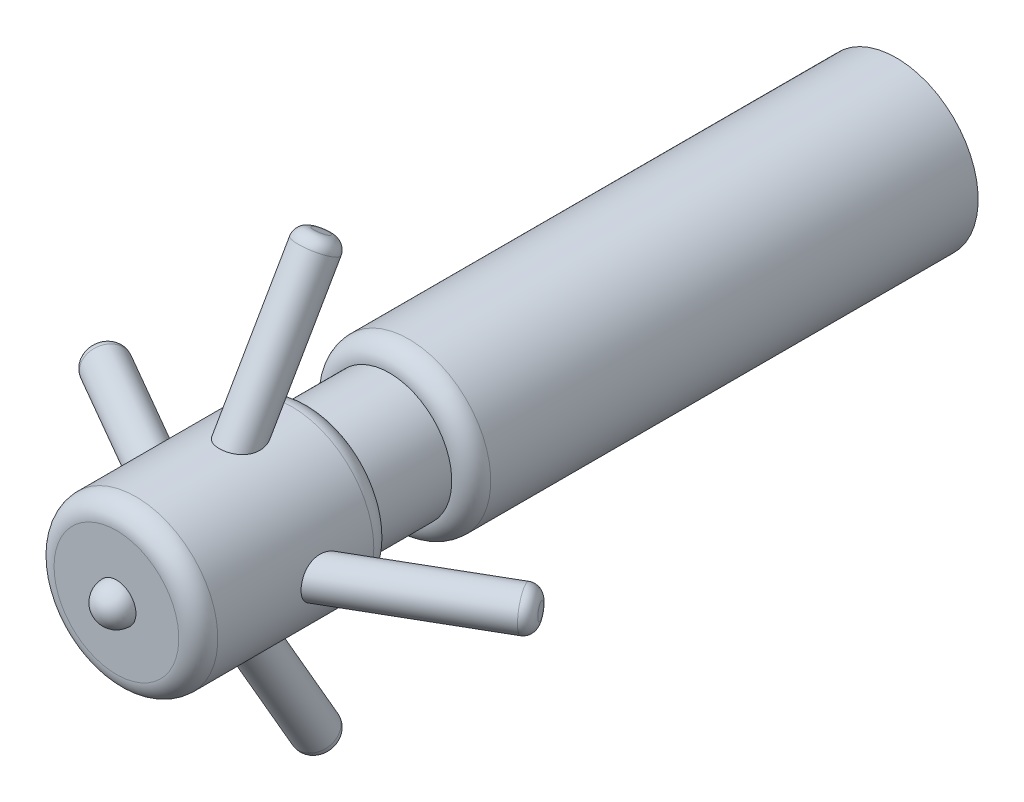
ISO-10303-21;
HEADER;
FILE_DESCRIPTION(('STEP AP214'),'2;1');
FILE_NAME('part.step','',(''),(''),'','','');
FILE_SCHEMA(('AUTOMOTIVE_DESIGN { 1 0 10303 214 1 1 1 1 }'));
ENDSEC;
DATA;
#1=APPLICATION_CONTEXT('core data for automotive mechanical design processes');
#2=APPLICATION_PROTOCOL_DEFINITION('international standard','automotive_design',2000,#1);
#3=PRODUCT_CONTEXT('',#1,'mechanical');
#4=PRODUCT('Part','Part','',(#3));
#5=PRODUCT_RELATED_PRODUCT_CATEGORY('part','',(#4));
#6=PRODUCT_DEFINITION_FORMATION('','',#4);
#7=PRODUCT_DEFINITION_CONTEXT('part definition',#1,'design');
#8=PRODUCT_DEFINITION('design','',#6,#7);
#9=PRODUCT_DEFINITION_SHAPE('','',#8);
#10=(LENGTH_UNIT() NAMED_UNIT(*) SI_UNIT(.MILLI.,.METRE.));
#11=(NAMED_UNIT(*) PLANE_ANGLE_UNIT() SI_UNIT($,.RADIAN.));
#12=(NAMED_UNIT(*) SI_UNIT($,.STERADIAN.) SOLID_ANGLE_UNIT());
#13=UNCERTAINTY_MEASURE_WITH_UNIT(LENGTH_MEASURE(1.E-05),#10,'distance_accuracy_value','');
#14=(GEOMETRIC_REPRESENTATION_CONTEXT(3) GLOBAL_UNCERTAINTY_ASSIGNED_CONTEXT((#13)) GLOBAL_UNIT_ASSIGNED_CONTEXT((#10,
#11,#12)) REPRESENTATION_CONTEXT('',''));
#15=CARTESIAN_POINT('',(0.,0.,0.));
#16=DIRECTION('',(0.,0.,1.));
#17=DIRECTION('',(1.,0.,0.));
#18=AXIS2_PLACEMENT_3D('',#15,#16,#17);
#19=CARTESIAN_POINT('',(0.,0.,20.));
#20=DIRECTION('',(0.,0.,-1.));
#21=DIRECTION('',(1.,0.,0.));
#22=AXIS2_PLACEMENT_3D('',#19,#20,#21);
#23=SPHERICAL_SURFACE('',#22,0.5);
#24=CARTESIAN_POINT('',(0.,0.,20.));
#25=DIRECTION('',(0.,0.,-1.));
#26=DIRECTION('',(-1.,0.,0.));
#27=AXIS2_PLACEMENT_3D('',#24,#25,#26);
#28=CIRCLE('',#27,0.5);
#29=CARTESIAN_POINT('',(-0.499999999999998,0.,20.));
#30=VERTEX_POINT('',#29);
#31=EDGE_CURVE('E160',#30,#30,#28,.T.);
#32=ORIENTED_EDGE('',*,*,#31,.F.);
#33=EDGE_LOOP('',(#32));
#34=FACE_BOUND('',#33,.T.);
#35=ADVANCED_FACE('F33',(#34),#23,.T.);
#36=CARTESIAN_POINT('',(0.500000000000003,0.,20.));
#37=DIRECTION('',(0.,0.,-1.));
#38=DIRECTION('',(-1.,0.,0.));
#39=AXIS2_PLACEMENT_3D('',#36,#37,#38);
#40=PLANE('',#39);
#41=CARTESIAN_POINT('',(0.,0.,20.));
#42=DIRECTION('',(0.,0.,-1.));
#43=DIRECTION('',(-1.,0.,0.));
#44=AXIS2_PLACEMENT_3D('',#41,#42,#43);
#45=CIRCLE('',#44,1.6);
#46=CARTESIAN_POINT('',(-1.59999999999999,0.,20.));
#47=VERTEX_POINT('',#46);
#48=EDGE_CURVE('E163',#47,#47,#45,.T.);
#49=ORIENTED_EDGE('',*,*,#48,.F.);
#50=EDGE_LOOP('',(#49));
#51=FACE_BOUND('',#50,.T.);
#52=ORIENTED_EDGE('',*,*,#31,.T.);
#53=EDGE_LOOP('',(#52));
#54=FACE_BOUND('',#53,.T.);
#55=ADVANCED_FACE('F152',(#51,#54),#40,.F.);
#56=CARTESIAN_POINT('',(0.,0.,19.5));
#57=DIRECTION('',(0.,0.,-1.));
#58=DIRECTION('',(-1.,0.,0.));
#59=AXIS2_PLACEMENT_3D('',#56,#57,#58);
#60=TOROIDAL_SURFACE('',#59,1.6,0.5);
#61=CARTESIAN_POINT('',(0.,0.,19.5));
#62=DIRECTION('',(0.,0.,-1.));
#63=DIRECTION('',(-1.,0.,0.));
#64=AXIS2_PLACEMENT_3D('',#61,#62,#63);
#65=CIRCLE('',#64,2.1);
#66=CARTESIAN_POINT('',(-2.1,0.,19.5));
#67=VERTEX_POINT('',#66);
#68=EDGE_CURVE('E167',#67,#67,#65,.T.);
#69=ORIENTED_EDGE('',*,*,#68,.F.);
#70=EDGE_LOOP('',(#69));
#71=FACE_BOUND('',#70,.T.);
#72=ORIENTED_EDGE('',*,*,#48,.T.);
#73=EDGE_LOOP('',(#72));
#74=FACE_BOUND('',#73,.T.);
#75=ADVANCED_FACE('F147',(#71,#74),#60,.T.);
#76=CARTESIAN_POINT('',(0.,0.,0.));
#77=DIRECTION('',(0.,0.,-1.));
#78=DIRECTION('',(-1.,0.,0.));
#79=AXIS2_PLACEMENT_3D('',#76,#77,#78);
#80=CYLINDRICAL_SURFACE('',#79,2.1);
#81=CARTESIAN_POINT('',(2.1,0.,17.3649147038915));
#82=CARTESIAN_POINT('',(2.10000013534698,0.0270170558608786,17.3649149600796));
#83=CARTESIAN_POINT('',(2.09947389495133,0.0540321101324294,17.362682637695));
#84=CARTESIAN_POINT('',(2.09742685160139,0.107287831584698,17.3538120437736));
#85=CARTESIAN_POINT('',(2.09590615334828,0.133528579984027,17.3471742360659));
#86=CARTESIAN_POINT('',(2.09203682808871,0.184486488805317,17.3296707766783));
#87=CARTESIAN_POINT('',(2.08968840637528,0.20920402523202,17.3188061732644));
#88=CARTESIAN_POINT('',(2.08441949205406,0.256438812860933,17.2931500051854));
#89=CARTESIAN_POINT('',(2.08149901159444,0.27895611077199,17.2783585239087));
#90=CARTESIAN_POINT('',(2.07537781948196,0.321356347266318,17.2451572676696));
#91=CARTESIAN_POINT('',(2.07217527613834,0.341219579433097,17.2267227015647));
#92=CARTESIAN_POINT('',(2.06584358018548,0.377668413517458,17.1868532793931));
#93=CARTESIAN_POINT('',(2.06271443313305,0.394253767968713,17.1654181970081));
#94=CARTESIAN_POINT('',(2.05673250454513,0.42437757110458,17.1193856937886));
#95=CARTESIAN_POINT('',(2.05389315252176,0.437789710924941,17.0947041064263));
#96=CARTESIAN_POINT('',(2.04888139395525,0.460676216341731,17.0435213855989));
#97=CARTESIAN_POINT('',(2.04670919882964,0.470149334024396,17.0170196785989));
#98=CARTESIAN_POINT('',(2.04305273215899,0.485804566358789,16.9606876323107));
#99=CARTESIAN_POINT('',(2.04163857678029,0.491657294939515,16.9307616842427));
#100=CARTESIAN_POINT('',(2.03985887629031,0.49898822205063,16.8703556441127));
#101=CARTESIAN_POINT('',(2.0394937643768,0.500464613400271,16.839875328354));
#102=CARTESIAN_POINT('',(2.03980213630231,0.49920790530019,16.7751434615066));
#103=CARTESIAN_POINT('',(2.04061309280366,0.49591767597866,16.7409034671232));
#104=CARTESIAN_POINT('',(2.0433749395959,0.484409692666091,16.6732919406647));
#105=CARTESIAN_POINT('',(2.04532693848286,0.476187146408223,16.6399212861905));
#106=CARTESIAN_POINT('',(2.05042096887334,0.453786505557318,16.5708804944482));
#107=CARTESIAN_POINT('',(2.05367699960968,0.439015988017886,16.5354094953734));
#108=CARTESIAN_POINT('',(2.06089886995535,0.403756472101983,16.4674983715522));
#109=CARTESIAN_POINT('',(2.06486431716247,0.383270631576743,16.4350565862673));
#110=CARTESIAN_POINT('',(2.07206297401812,0.341892415598992,16.381339196235));
#111=CARTESIAN_POINT('',(2.0752606449846,0.322124407818175,16.3591920737751));
#112=CARTESIAN_POINT('',(2.08146131694597,0.279259443097254,16.3183635594363));
#113=CARTESIAN_POINT('',(2.08446461777478,0.256167799619382,16.2996767426119));
#114=CARTESIAN_POINT('',(2.08940704680269,0.21161201198238,16.2699426125728));
#115=CARTESIAN_POINT('',(2.09143987391839,0.19067895649521,16.2581179004268));
#116=CARTESIAN_POINT('',(2.09495442737949,0.147112038001296,16.2380376588472));
#117=CARTESIAN_POINT('',(2.09643651016618,0.124479286479753,16.2297798203719));
#118=CARTESIAN_POINT('',(2.09868433436348,0.0779092196004576,16.2173616516538));
#119=CARTESIAN_POINT('',(2.09944545237326,0.0539645123058211,16.2132277585759));
#120=CARTESIAN_POINT('',(2.10013055186416,0.00571283440946461,16.2095033670868));
#121=CARTESIAN_POINT('',(2.10005487599663,-0.0185939838431219,16.2099110090031));
#122=CARTESIAN_POINT('',(2.09913048565165,-0.0641599620608656,16.2149447287968));
#123=CARTESIAN_POINT('',(2.09836341877521,-0.0854720661027792,16.2191253176157));
#124=CARTESIAN_POINT('',(2.09625237617656,-0.127126929428398,16.2308085790678));
#125=CARTESIAN_POINT('',(2.09490832730107,-0.147469565433567,16.2383116729521));
#126=CARTESIAN_POINT('',(2.09170109037234,-0.187645926044249,16.256615365473));
#127=CARTESIAN_POINT('',(2.08981769869844,-0.207418083878499,16.267546288707));
#128=CARTESIAN_POINT('',(2.0857221477503,-0.245204266217458,16.2920555196805));
#129=CARTESIAN_POINT('',(2.08350974740615,-0.263216985383101,16.3056357709197));
#130=CARTESIAN_POINT('',(2.07784741190989,-0.305264170745404,16.3417717880896));
#131=CARTESIAN_POINT('',(2.07429909016047,-0.328221108462538,16.3655706029834));
#132=CARTESIAN_POINT('',(2.06726634480154,-0.369944883708094,16.4166038751656));
#133=CARTESIAN_POINT('',(2.06378203243842,-0.38870496251785,16.4438437652384));
#134=CARTESIAN_POINT('',(2.05718999426136,-0.422214024555062,16.5012290293635));
#135=CARTESIAN_POINT('',(2.05408811941643,-0.436904172795407,16.5314092683357));
#136=CARTESIAN_POINT('',(2.04862380073636,-0.461847686310299,16.5936016354477));
#137=CARTESIAN_POINT('',(2.04626134933996,-0.472101096954919,16.625613744851));
#138=CARTESIAN_POINT('',(2.04223391007567,-0.489256651354719,16.6959592864633));
#139=CARTESIAN_POINT('',(2.04073664696461,-0.495379951350437,16.734496123406));
#140=CARTESIAN_POINT('',(2.03935724630288,-0.501030518456224,16.8121113960749));
#141=CARTESIAN_POINT('',(2.03947551094671,-0.500556143038308,16.851189964249));
#142=CARTESIAN_POINT('',(2.04140263620674,-0.492637464185869,16.9272154609909));
#143=CARTESIAN_POINT('',(2.04315119144442,-0.485441768872929,16.9641887606865));
#144=CARTESIAN_POINT('',(2.04810935822316,-0.464077651127205,17.0359599772734));
#145=CARTESIAN_POINT('',(2.05131703919534,-0.449918440117621,17.0707606997278));
#146=CARTESIAN_POINT('',(2.05821647195102,-0.417111902889281,17.1319618207609));
#147=CARTESIAN_POINT('',(2.0617791558553,-0.399360809433103,17.1588576582524));
#148=CARTESIAN_POINT('',(2.06917746723406,-0.359056879331339,17.2087312468116));
#149=CARTESIAN_POINT('',(2.07301289316437,-0.336507564305023,17.231711849283));
#150=CARTESIAN_POINT('',(2.07998659418494,-0.290073077223859,17.2704852754232));
#151=CARTESIAN_POINT('',(2.08315478044131,-0.266622656068293,17.28679558492));
#152=CARTESIAN_POINT('',(2.08888978435223,-0.217158441562169,17.3150546143603));
#153=CARTESIAN_POINT('',(2.09145673714156,-0.191145226102814,17.3270043147432));
#154=CARTESIAN_POINT('',(2.09562605959526,-0.138002269492198,17.3459414886458));
#155=CARTESIAN_POINT('',(2.09724990625089,-0.110913763757647,17.3530401584525));
#156=CARTESIAN_POINT('',(2.09943675443007,-0.0558827357357511,17.3625264025123));
#157=CARTESIAN_POINT('',(2.09999986002788,-0.0279402975051137,17.3649144389487));
#158=CARTESIAN_POINT('',(2.1,0.,17.3649147038915));
#159=B_SPLINE_CURVE_WITH_KNOTS('',3,(#81,#82,#83,#84,#85,#86,#87,#88,#89,#90,#91,#92,#93,#94,
#95,#96,#97,#98,#99,#100,#101,#102,#103,#104,#105,#106,#107,#108,#109,#110,#111,#112,#113,#114,
#115,#116,#117,#118,#119,#120,#121,#122,#123,#124,#125,#126,#127,#128,#129,#130,#131,#132,#133,
#134,#135,#136,#137,#138,#139,#140,#141,#142,#143,#144,#145,#146,#147,#148,#149,#150,#151,#152,
#153,#154,#155,#156,#157,#158),.UNSPECIFIED.,.T.,.F.,(4,2,2,2,2,2,2,2,2,2,2,2,2,2,2,2,2,2,2,2,2,
2,2,2,2,2,2,2,2,2,2,2,2,2,2,2,2,2,4),(0.,0.0809513147617417,0.161894107962201,0.242816839736671,
0.323737853229657,0.405229771528635,0.4867278397851,0.571065745582899,0.655430349984879,
0.746640052437077,0.837887414114922,0.940697549231867,1.0436077374186,1.1587681547082,
1.27386506872749,1.36311542747421,1.45222465555415,1.52431978495746,1.59636817284898,
1.66887552542989,1.74135318871538,1.80625338360568,1.87116180936938,1.93892030973865,
2.00672870472036,2.10595927272785,2.20534851162714,2.3061073291602,2.40686511630936,
2.52344124026573,2.64004638701584,2.75250243039203,2.86481011405151,2.96152283588193,
3.05816481945491,3.14394850071515,3.22971288247073,3.31343872510094,3.39715635257019),.UNSPECIFIED.);
#160=CARTESIAN_POINT('',(2.1,0.,17.3649147038915));
#161=VERTEX_POINT('',#160);
#162=EDGE_CURVE('E59',#161,#161,#159,.T.);
#163=ORIENTED_EDGE('',*,*,#162,.T.);
#164=EDGE_LOOP('',(#163));
#165=FACE_BOUND('',#164,.T.);
#166=CARTESIAN_POINT('',(0.,-2.1,17.3649147038915));
#167=CARTESIAN_POINT('',(0.0270170558608737,-2.10000013534698,17.3649149600796));
#168=CARTESIAN_POINT('',(0.0540321101324249,-2.09947389495132,17.362682637695));
#169=CARTESIAN_POINT('',(0.107287831584694,-2.09742685160139,17.3538120437736));
#170=CARTESIAN_POINT('',(0.133528579984022,-2.09590615334828,17.3471742360659));
#171=CARTESIAN_POINT('',(0.184486488805311,-2.09203682808871,17.3296707766783));
#172=CARTESIAN_POINT('',(0.209204025232015,-2.08968840637528,17.3188061732644));
#173=CARTESIAN_POINT('',(0.256438812860928,-2.08441949205405,17.2931500051854));
#174=CARTESIAN_POINT('',(0.278956110771985,-2.08149901159444,17.2783585239087));
#175=CARTESIAN_POINT('',(0.321356347266314,-2.07537781948196,17.2451572676696));
#176=CARTESIAN_POINT('',(0.341219579433096,-2.07217527613834,17.2267227015647));
#177=CARTESIAN_POINT('',(0.377668413517456,-2.06584358018547,17.1868532793931));
#178=CARTESIAN_POINT('',(0.39425376796871,-2.06271443313305,17.1654181970081));
#179=CARTESIAN_POINT('',(0.424377571104576,-2.05673250454513,17.1193856937886));
#180=CARTESIAN_POINT('',(0.437789710924939,-2.05389315252176,17.0947041064263));
#181=CARTESIAN_POINT('',(0.460676216341728,-2.04888139395525,17.0435213855989));
#182=CARTESIAN_POINT('',(0.470149334024392,-2.04670919882963,17.0170196785989));
#183=CARTESIAN_POINT('',(0.485804566358785,-2.04305273215899,16.9606876323107));
#184=CARTESIAN_POINT('',(0.491657294939511,-2.04163857678029,16.9307616842427));
#185=CARTESIAN_POINT('',(0.498988222050625,-2.03985887629031,16.8703556441127));
#186=CARTESIAN_POINT('',(0.500464613400266,-2.0394937643768,16.839875328354));
#187=CARTESIAN_POINT('',(0.499207905300185,-2.03980213630231,16.7751434615066));
#188=CARTESIAN_POINT('',(0.495917675978655,-2.04061309280366,16.7409034671232));
#189=CARTESIAN_POINT('',(0.484409692666086,-2.0433749395959,16.6732919406647));
#190=CARTESIAN_POINT('',(0.476187146408218,-2.04532693848286,16.6399212861905));
#191=CARTESIAN_POINT('',(0.453786505557313,-2.05042096887334,16.5708804944482));
#192=CARTESIAN_POINT('',(0.43901598801788,-2.05367699960967,16.5354094953734));
#193=CARTESIAN_POINT('',(0.403756472101976,-2.06089886995535,16.4674983715522));
#194=CARTESIAN_POINT('',(0.383270631576736,-2.06486431716247,16.4350565862673));
#195=CARTESIAN_POINT('',(0.341892415598984,-2.07206297401812,16.381339196235));
#196=CARTESIAN_POINT('',(0.322124407818167,-2.07526064498459,16.3591920737751));
#197=CARTESIAN_POINT('',(0.279259443097246,-2.08146131694597,16.3183635594363));
#198=CARTESIAN_POINT('',(0.256167799619374,-2.08446461777478,16.2996767426119));
#199=CARTESIAN_POINT('',(0.211612011982371,-2.08940704680268,16.2699426125728));
#200=CARTESIAN_POINT('',(0.190678956495202,-2.09143987391839,16.2581179004268));
#201=CARTESIAN_POINT('',(0.147112038001289,-2.09495442737949,16.2380376588472));
#202=CARTESIAN_POINT('',(0.124479286479747,-2.09643651016617,16.2297798203719));
#203=CARTESIAN_POINT('',(0.0779092196004529,-2.09868433436348,16.2173616516538));
#204=CARTESIAN_POINT('',(0.053964512305817,-2.09944545237325,16.2132277585759));
#205=CARTESIAN_POINT('',(0.00571283440946191,-2.10013055186416,16.2095033670868));
#206=CARTESIAN_POINT('',(-0.018593983843124,-2.10005487599662,16.2099110090031));
#207=CARTESIAN_POINT('',(-0.0641599620608665,-2.09913048565165,16.2149447287968));
#208=CARTESIAN_POINT('',(-0.0854720661027795,-2.09836341877521,16.2191253176157));
#209=CARTESIAN_POINT('',(-0.127126929428399,-2.09625237617656,16.2308085790678));
#210=CARTESIAN_POINT('',(-0.147469565433569,-2.09490832730106,16.2383116729521));
#211=CARTESIAN_POINT('',(-0.187645926044252,-2.09170109037234,16.256615365473));
#212=CARTESIAN_POINT('',(-0.207418083878502,-2.08981769869844,16.267546288707));
#213=CARTESIAN_POINT('',(-0.24520426621746,-2.0857221477503,16.2920555196805));
#214=CARTESIAN_POINT('',(-0.263216985383103,-2.08350974740615,16.3056357709197));
#215=CARTESIAN_POINT('',(-0.305264170745405,-2.07784741190989,16.3417717880896));
#216=CARTESIAN_POINT('',(-0.328221108462539,-2.07429909016047,16.3655706029834));
#217=CARTESIAN_POINT('',(-0.369944883708096,-2.06726634480153,16.4166038751656));
#218=CARTESIAN_POINT('',(-0.388704962517853,-2.06378203243841,16.4438437652384));
#219=CARTESIAN_POINT('',(-0.422214024555064,-2.05718999426136,16.5012290293635));
#220=CARTESIAN_POINT('',(-0.436904172795409,-2.05408811941642,16.5314092683357));
#221=CARTESIAN_POINT('',(-0.461847686310301,-2.04862380073636,16.5936016354477));
#222=CARTESIAN_POINT('',(-0.472101096954922,-2.04626134933996,16.625613744851));
#223=CARTESIAN_POINT('',(-0.489256651354723,-2.04223391007567,16.6959592864633));
#224=CARTESIAN_POINT('',(-0.495379951350441,-2.0407366469646,16.7344961234059));
#225=CARTESIAN_POINT('',(-0.501030518456229,-2.03935724630287,16.8121113960749));
#226=CARTESIAN_POINT('',(-0.500556143038313,-2.0394755109467,16.851189964249));
#227=CARTESIAN_POINT('',(-0.492637464185875,-2.04140263620673,16.9272154609909));
#228=CARTESIAN_POINT('',(-0.485441768872935,-2.04315119144442,16.9641887606865));
#229=CARTESIAN_POINT('',(-0.464077651127212,-2.04810935822316,17.0359599772734));
#230=CARTESIAN_POINT('',(-0.449918440117628,-2.05131703919533,17.0707606997278));
#231=CARTESIAN_POINT('',(-0.417111902889288,-2.05821647195101,17.1319618207609));
#232=CARTESIAN_POINT('',(-0.39936080943311,-2.06177915585529,17.1588576582524));
#233=CARTESIAN_POINT('',(-0.359056879331347,-2.06917746723405,17.2087312468116));
#234=CARTESIAN_POINT('',(-0.33650756430503,-2.07301289316436,17.231711849283));
#235=CARTESIAN_POINT('',(-0.290073077223867,-2.07998659418494,17.2704852754232));
#236=CARTESIAN_POINT('',(-0.266622656068301,-2.08315478044131,17.28679558492));
#237=CARTESIAN_POINT('',(-0.217158441562177,-2.08888978435222,17.3150546143603));
#238=CARTESIAN_POINT('',(-0.191145226102822,-2.09145673714156,17.3270043147432));
#239=CARTESIAN_POINT('',(-0.138002269492206,-2.09562605959526,17.3459414886457));
#240=CARTESIAN_POINT('',(-0.110913763757655,-2.09724990625089,17.3530401584525));
#241=CARTESIAN_POINT('',(-0.0558827357357578,-2.09943675443007,17.3625264025123));
#242=CARTESIAN_POINT('',(-0.0279402975051197,-2.09999986002787,17.3649144389487));
#243=CARTESIAN_POINT('',(0.,-2.1,17.3649147038915));
#244=B_SPLINE_CURVE_WITH_KNOTS('',3,(#166,#167,#168,#169,#170,#171,#172,#173,#174,#175,#176,
#177,#178,#179,#180,#181,#182,#183,#184,#185,#186,#187,#188,#189,#190,#191,#192,#193,#194,#195,
#196,#197,#198,#199,#200,#201,#202,#203,#204,#205,#206,#207,#208,#209,#210,#211,#212,#213,#214,
#215,#216,#217,#218,#219,#220,#221,#222,#223,#224,#225,#226,#227,#228,#229,#230,#231,#232,#233,
#234,#235,#236,#237,#238,#239,#240,#241,#242,#243),.UNSPECIFIED.,.T.,.F.,(4,2,2,2,2,2,2,2,2,2,2,
2,2,2,2,2,2,2,2,2,2,2,2,2,2,2,2,2,2,2,2,2,2,2,2,2,2,2,4),(0.,0.080951314761742,
0.161894107962202,0.24281683973667,0.323737853229659,0.405229771528638,0.486727839785102,
0.571065745582905,0.655430349984882,0.746640052437079,0.837887414114925,0.940697549231866,
1.0436077374186,1.1587681547082,1.2738650687275,1.36311542747421,1.45222465555416,
1.52431978495746,1.59636817284898,1.66887552542989,1.74135318871538,1.80625338360568,
1.87116180936938,1.93892030973864,2.00672870472035,2.10595927272784,2.20534851162714,
2.30610732916019,2.40686511630935,2.52344124026572,2.64004638701583,2.75250243039202,
2.86481011405151,2.96152283588192,3.0581648194549,3.14394850071514,3.22971288247072,
3.31343872510093,3.39715635257019),.UNSPECIFIED.);
#245=CARTESIAN_POINT('',(0.,-2.1,17.3649147038915));
#246=VERTEX_POINT('',#245);
#247=EDGE_CURVE('E66',#246,#246,#244,.T.);
#248=ORIENTED_EDGE('',*,*,#247,.T.);
#249=EDGE_LOOP('',(#248));
#250=FACE_BOUND('',#249,.T.);
#251=CARTESIAN_POINT('',(-2.1,0.,17.3649147038915));
#252=CARTESIAN_POINT('',(-2.10000013534698,-0.0270170558608551,17.3649149600796));
#253=CARTESIAN_POINT('',(-2.09947389495132,-0.0540321101324066,17.362682637695));
#254=CARTESIAN_POINT('',(-2.09742685160139,-0.107287831584676,17.3538120437736));
#255=CARTESIAN_POINT('',(-2.09590615334828,-0.133528579984004,17.3471742360659));
#256=CARTESIAN_POINT('',(-2.0920368280887,-0.184486488805293,17.3296707766783));
#257=CARTESIAN_POINT('',(-2.08968840637528,-0.209204025231996,17.3188061732644));
#258=CARTESIAN_POINT('',(-2.08441949205405,-0.25643881286091,17.2931500051854));
#259=CARTESIAN_POINT('',(-2.08149901159444,-0.278956110771968,17.2783585239087));
#260=CARTESIAN_POINT('',(-2.07537781948196,-0.321356347266298,17.2451572676696));
#261=CARTESIAN_POINT('',(-2.07217527613834,-0.341219579433079,17.2267227015647));
#262=CARTESIAN_POINT('',(-2.06584358018547,-0.37766841351744,17.1868532793931));
#263=CARTESIAN_POINT('',(-2.06271443313305,-0.394253767968694,17.1654181970081));
#264=CARTESIAN_POINT('',(-2.05673250454513,-0.424377571104561,17.1193856937886));
#265=CARTESIAN_POINT('',(-2.05389315252176,-0.437789710924923,17.0947041064263));
#266=CARTESIAN_POINT('',(-2.04888139395525,-0.460676216341714,17.0435213855989));
#267=CARTESIAN_POINT('',(-2.04670919882963,-0.470149334024379,17.0170196785989));
#268=CARTESIAN_POINT('',(-2.04305273215899,-0.485804566358773,16.9606876323107));
#269=CARTESIAN_POINT('',(-2.04163857678029,-0.4916572949395,16.9307616842427));
#270=CARTESIAN_POINT('',(-2.03985887629031,-0.498988222050615,16.8703556441127));
#271=CARTESIAN_POINT('',(-2.0394937643768,-0.500464613400257,16.839875328354));
#272=CARTESIAN_POINT('',(-2.0398021363023,-0.499207905300176,16.7751434615067));
#273=CARTESIAN_POINT('',(-2.04061309280366,-0.495917675978647,16.7409034671232));
#274=CARTESIAN_POINT('',(-2.0433749395959,-0.48440969266608,16.6732919406647));
#275=CARTESIAN_POINT('',(-2.04532693848286,-0.476187146408212,16.6399212861905));
#276=CARTESIAN_POINT('',(-2.05042096887334,-0.453786505557308,16.5708804944482));
#277=CARTESIAN_POINT('',(-2.05367699960967,-0.439015988017875,16.5354094953734));
#278=CARTESIAN_POINT('',(-2.06089886995535,-0.403756472101973,16.4674983715523));
#279=CARTESIAN_POINT('',(-2.06486431716247,-0.383270631576734,16.4350565862673));
#280=CARTESIAN_POINT('',(-2.07206297401812,-0.341892415598984,16.381339196235));
#281=CARTESIAN_POINT('',(-2.07526064498459,-0.322124407818167,16.3591920737751));
#282=CARTESIAN_POINT('',(-2.08146131694597,-0.279259443097247,16.3183635594363));
#283=CARTESIAN_POINT('',(-2.08446461777477,-0.256167799619375,16.2996767426119));
#284=CARTESIAN_POINT('',(-2.08940704680268,-0.211612011982371,16.2699426125728));
#285=CARTESIAN_POINT('',(-2.09143987391839,-0.190678956495201,16.2581179004268));
#286=CARTESIAN_POINT('',(-2.09495442737949,-0.147112038001286,16.2380376588472));
#287=CARTESIAN_POINT('',(-2.09643651016617,-0.124479286479744,16.2297798203719));
#288=CARTESIAN_POINT('',(-2.09868433436347,-0.0779092196004479,16.2173616516538));
#289=CARTESIAN_POINT('',(-2.09944545237325,-0.053964512305811,16.2132277585759));
#290=CARTESIAN_POINT('',(-2.10013055186416,-0.00571283440945387,16.2095033670868));
#291=CARTESIAN_POINT('',(-2.10005487599662,0.018593983843133,16.2099110090031));
#292=CARTESIAN_POINT('',(-2.09913048565164,0.0641599620608765,16.2149447287968));
#293=CARTESIAN_POINT('',(-2.0983634187752,0.0854720661027896,16.2191253176157));
#294=CARTESIAN_POINT('',(-2.09625237617656,0.127126929428409,16.2308085790678));
#295=CARTESIAN_POINT('',(-2.09490832730106,0.147469565433579,16.2383116729521));
#296=CARTESIAN_POINT('',(-2.09170109037233,0.187645926044262,16.256615365473));
#297=CARTESIAN_POINT('',(-2.08981769869844,0.207418083878512,16.267546288707));
#298=CARTESIAN_POINT('',(-2.0857221477503,0.24520426621747,16.2920555196805));
#299=CARTESIAN_POINT('',(-2.08350974740615,0.263216985383113,16.3056357709197));
#300=CARTESIAN_POINT('',(-2.07784741190988,0.305264170745415,16.3417717880896));
#301=CARTESIAN_POINT('',(-2.07429909016047,0.328221108462549,16.3655706029834));
#302=CARTESIAN_POINT('',(-2.06726634480153,0.369944883708105,16.4166038751656));
#303=CARTESIAN_POINT('',(-2.06378203243841,0.388704962517863,16.4438437652384));
#304=CARTESIAN_POINT('',(-2.05718999426135,0.422214024555074,16.5012290293635));
#305=CARTESIAN_POINT('',(-2.05408811941642,0.436904172795418,16.5314092683357));
#306=CARTESIAN_POINT('',(-2.04862380073636,0.46184768631031,16.5936016354477));
#307=CARTESIAN_POINT('',(-2.04626134933995,0.472101096954931,16.625613744851));
#308=CARTESIAN_POINT('',(-2.04223391007566,0.489256651354732,16.6959592864633));
#309=CARTESIAN_POINT('',(-2.0407366469646,0.49537995135045,16.7344961234059));
#310=CARTESIAN_POINT('',(-2.03935724630287,0.501030518456238,16.8121113960749));
#311=CARTESIAN_POINT('',(-2.0394755109467,0.500556143038322,16.851189964249));
#312=CARTESIAN_POINT('',(-2.04140263620673,0.492637464185884,16.9272154609909));
#313=CARTESIAN_POINT('',(-2.04315119144441,0.485441768872945,16.9641887606865));
#314=CARTESIAN_POINT('',(-2.04810935822315,0.464077651127221,17.0359599772734));
#315=CARTESIAN_POINT('',(-2.05131703919533,0.449918440117638,17.0707606997278));
#316=CARTESIAN_POINT('',(-2.05821647195101,0.417111902889299,17.1319618207609));
#317=CARTESIAN_POINT('',(-2.06177915585529,0.399360809433121,17.1588576582524));
#318=CARTESIAN_POINT('',(-2.06917746723405,0.359056879331358,17.2087312468116));
#319=CARTESIAN_POINT('',(-2.07301289316436,0.336507564305041,17.231711849283));
#320=CARTESIAN_POINT('',(-2.07998659418493,0.290073077223877,17.2704852754232));
#321=CARTESIAN_POINT('',(-2.0831547804413,0.26662265606831,17.28679558492));
#322=CARTESIAN_POINT('',(-2.08888978435222,0.217158441562187,17.3150546143603));
#323=CARTESIAN_POINT('',(-2.09145673714155,0.191145226102833,17.3270043147432));
#324=CARTESIAN_POINT('',(-2.09562605959525,0.138002269492219,17.3459414886457));
#325=CARTESIAN_POINT('',(-2.09724990625089,0.110913763757669,17.3530401584525));
#326=CARTESIAN_POINT('',(-2.09943675443007,0.0558827357357747,17.3625264025123));
#327=CARTESIAN_POINT('',(-2.09999986002787,0.0279402975051376,17.3649144389487));
#328=CARTESIAN_POINT('',(-2.1,0.,17.3649147038915));
#329=B_SPLINE_CURVE_WITH_KNOTS('',3,(#251,#252,#253,#254,#255,#256,#257,#258,#259,#260,#261,
#262,#263,#264,#265,#266,#267,#268,#269,#270,#271,#272,#273,#274,#275,#276,#277,#278,#279,#280,
#281,#282,#283,#284,#285,#286,#287,#288,#289,#290,#291,#292,#293,#294,#295,#296,#297,#298,#299,
#300,#301,#302,#303,#304,#305,#306,#307,#308,#309,#310,#311,#312,#313,#314,#315,#316,#317,#318,
#319,#320,#321,#322,#323,#324,#325,#326,#327,#328),.UNSPECIFIED.,.T.,.F.,(4,2,2,2,2,2,2,2,2,2,2,
2,2,2,2,2,2,2,2,2,2,2,2,2,2,2,2,2,2,2,2,2,2,2,2,2,2,2,4),(0.,0.0809513147617429,
0.161894107962202,0.242816839736669,0.323737853229658,0.405229771528638,0.486727839785099,
0.571065745582899,0.65543034998488,0.746640052437078,0.837887414114923,0.940697549231865,
1.04360773741859,1.15876815470819,1.27386506872749,1.36311542747421,1.45222465555415,
1.52431978495746,1.59636817284898,1.66887552542989,1.74135318871539,1.80625338360569,
1.87116180936939,1.93892030973865,2.00672870472036,2.10595927272785,2.20534851162715,
2.3061073291602,2.40686511630936,2.52344124026573,2.64004638701584,2.75250243039203,
2.86481011405151,2.96152283588193,3.05816481945491,3.14394850071515,3.22971288247073,
3.31343872510094,3.39715635257019),.UNSPECIFIED.);
#330=CARTESIAN_POINT('',(-2.1,0.,17.3649147038915));
#331=VERTEX_POINT('',#330);
#332=EDGE_CURVE('E101',#331,#331,#329,.T.);
#333=ORIENTED_EDGE('',*,*,#332,.T.);
#334=EDGE_LOOP('',(#333));
#335=FACE_BOUND('',#334,.T.);
#336=CARTESIAN_POINT('',(0.,2.1,17.3649147038915));
#337=CARTESIAN_POINT('',(-0.027017055860855,2.10000013534698,17.3649149600796));
#338=CARTESIAN_POINT('',(-0.0540321101324064,2.09947389495132,17.362682637695));
#339=CARTESIAN_POINT('',(-0.107287831584675,2.09742685160139,17.3538120437736));
#340=CARTESIAN_POINT('',(-0.133528579984003,2.09590615334828,17.3471742360659));
#341=CARTESIAN_POINT('',(-0.184486488805292,2.09203682808871,17.3296707766783));
#342=CARTESIAN_POINT('',(-0.209204025231996,2.08968840637528,17.3188061732644));
#343=CARTESIAN_POINT('',(-0.256438812860909,2.08441949205406,17.2931500051854));
#344=CARTESIAN_POINT('',(-0.278956110771966,2.08149901159444,17.2783585239087));
#345=CARTESIAN_POINT('',(-0.321356347266296,2.07537781948196,17.2451572676696));
#346=CARTESIAN_POINT('',(-0.341219579433077,2.07217527613834,17.2267227015647));
#347=CARTESIAN_POINT('',(-0.377668413517438,2.06584358018548,17.1868532793931));
#348=CARTESIAN_POINT('',(-0.394253767968691,2.06271443313305,17.1654181970081));
#349=CARTESIAN_POINT('',(-0.424377571104558,2.05673250454513,17.1193856937886));
#350=CARTESIAN_POINT('',(-0.43778971092492,2.05389315252176,17.0947041064263));
#351=CARTESIAN_POINT('',(-0.46067621634171,2.04888139395525,17.0435213855989));
#352=CARTESIAN_POINT('',(-0.470149334024374,2.04670919882964,17.0170196785989));
#353=CARTESIAN_POINT('',(-0.485804566358767,2.04305273215899,16.9606876323107));
#354=CARTESIAN_POINT('',(-0.491657294939492,2.04163857678029,16.9307616842427));
#355=CARTESIAN_POINT('',(-0.498988222050606,2.03985887629031,16.8703556441127));
#356=CARTESIAN_POINT('',(-0.500464613400248,2.0394937643768,16.839875328354));
#357=CARTESIAN_POINT('',(-0.499207905300166,2.03980213630231,16.7751434615066));
#358=CARTESIAN_POINT('',(-0.495917675978637,2.04061309280366,16.7409034671232));
#359=CARTESIAN_POINT('',(-0.484409692666068,2.0433749395959,16.6732919406647));
#360=CARTESIAN_POINT('',(-0.4761871464082,2.04532693848286,16.6399212861905));
#361=CARTESIAN_POINT('',(-0.453786505557294,2.05042096887334,16.5708804944482));
#362=CARTESIAN_POINT('',(-0.439015988017861,2.05367699960968,16.5354094953734));
#363=CARTESIAN_POINT('',(-0.403756472101957,2.06089886995536,16.4674983715522));
#364=CARTESIAN_POINT('',(-0.383270631576717,2.06486431716248,16.4350565862673));
#365=CARTESIAN_POINT('',(-0.341892415598966,2.07206297401812,16.381339196235));
#366=CARTESIAN_POINT('',(-0.322124407818148,2.0752606449846,16.3591920737751));
#367=CARTESIAN_POINT('',(-0.279259443097227,2.08146131694597,16.3183635594363));
#368=CARTESIAN_POINT('',(-0.256167799619355,2.08446461777478,16.2996767426119));
#369=CARTESIAN_POINT('',(-0.211612011982353,2.08940704680269,16.2699426125728));
#370=CARTESIAN_POINT('',(-0.190678956495184,2.09143987391839,16.2581179004268));
#371=CARTESIAN_POINT('',(-0.14711203800127,2.09495442737949,16.2380376588472));
#372=CARTESIAN_POINT('',(-0.124479286479728,2.09643651016618,16.2297798203719));
#373=CARTESIAN_POINT('',(-0.0779092196004341,2.09868433436348,16.2173616516538));
#374=CARTESIAN_POINT('',(-0.0539645123057983,2.09944545237325,16.2132277585759));
#375=CARTESIAN_POINT('',(-0.00571283440944313,2.10013055186416,16.2095033670868));
#376=CARTESIAN_POINT('',(0.0185939838431428,2.10005487599662,16.2099110090031));
#377=CARTESIAN_POINT('',(0.0641599620608853,2.09913048565165,16.2149447287968));
#378=CARTESIAN_POINT('',(0.0854720661027982,2.09836341877521,16.2191253176157));
#379=CARTESIAN_POINT('',(0.127126929428417,2.09625237617656,16.2308085790678));
#380=CARTESIAN_POINT('',(0.147469565433587,2.09490832730106,16.2383116729521));
#381=CARTESIAN_POINT('',(0.18764592604427,2.09170109037234,16.256615365473));
#382=CARTESIAN_POINT('',(0.20741808387852,2.08981769869844,16.267546288707));
#383=CARTESIAN_POINT('',(0.245204266217477,2.0857221477503,16.2920555196805));
#384=CARTESIAN_POINT('',(0.263216985383121,2.08350974740615,16.3056357709197));
#385=CARTESIAN_POINT('',(0.305264170745424,2.07784741190988,16.3417717880896));
#386=CARTESIAN_POINT('',(0.328221108462558,2.07429909016047,16.3655706029834));
#387=CARTESIAN_POINT('',(0.369944883708114,2.06726634480153,16.4166038751656));
#388=CARTESIAN_POINT('',(0.388704962517872,2.06378203243841,16.4438437652384));
#389=CARTESIAN_POINT('',(0.422214024555083,2.05718999426135,16.5012290293635));
#390=CARTESIAN_POINT('',(0.436904172795427,2.05408811941642,16.5314092683357));
#391=CARTESIAN_POINT('',(0.461847686310319,2.04862380073636,16.5936016354477));
#392=CARTESIAN_POINT('',(0.47210109695494,2.04626134933995,16.625613744851));
#393=CARTESIAN_POINT('',(0.489256651354741,2.04223391007567,16.6959592864633));
#394=CARTESIAN_POINT('',(0.49537995135046,2.0407366469646,16.7344961234059));
#395=CARTESIAN_POINT('',(0.501030518456247,2.03935724630287,16.8121113960749));
#396=CARTESIAN_POINT('',(0.500556143038331,2.0394755109467,16.851189964249));
#397=CARTESIAN_POINT('',(0.492637464185893,2.04140263620673,16.9272154609909));
#398=CARTESIAN_POINT('',(0.485441768872954,2.04315119144441,16.9641887606865));
#399=CARTESIAN_POINT('',(0.46407765112723,2.04810935822315,17.0359599772734));
#400=CARTESIAN_POINT('',(0.449918440117647,2.05131703919533,17.0707606997278));
#401=CARTESIAN_POINT('',(0.417111902889306,2.05821647195101,17.1319618207609));
#402=CARTESIAN_POINT('',(0.399360809433129,2.06177915585529,17.1588576582524));
#403=CARTESIAN_POINT('',(0.359056879331366,2.06917746723405,17.2087312468116));
#404=CARTESIAN_POINT('',(0.336507564305049,2.07301289316436,17.231711849283));
#405=CARTESIAN_POINT('',(0.290073077223886,2.07998659418493,17.2704852754232));
#406=CARTESIAN_POINT('',(0.26662265606832,2.08315478044131,17.28679558492));
#407=CARTESIAN_POINT('',(0.217158441562195,2.08888978435222,17.3150546143603));
#408=CARTESIAN_POINT('',(0.191145226102841,2.09145673714156,17.3270043147432));
#409=CARTESIAN_POINT('',(0.138002269492225,2.09562605959526,17.3459414886457));
#410=CARTESIAN_POINT('',(0.110913763757674,2.09724990625089,17.3530401584525));
#411=CARTESIAN_POINT('',(0.055882735735777,2.09943675443007,17.3625264025123));
#412=CARTESIAN_POINT('',(0.0279402975051387,2.09999986002787,17.3649144389487));
#413=CARTESIAN_POINT('',(0.,2.1,17.3649147038915));
#414=B_SPLINE_CURVE_WITH_KNOTS('',3,(#336,#337,#338,#339,#340,#341,#342,#343,#344,#345,#346,
#347,#348,#349,#350,#351,#352,#353,#354,#355,#356,#357,#358,#359,#360,#361,#362,#363,#364,#365,
#366,#367,#368,#369,#370,#371,#372,#373,#374,#375,#376,#377,#378,#379,#380,#381,#382,#383,#384,
#385,#386,#387,#388,#389,#390,#391,#392,#393,#394,#395,#396,#397,#398,#399,#400,#401,#402,#403,
#404,#405,#406,#407,#408,#409,#410,#411,#412,#413),.UNSPECIFIED.,.T.,.F.,(4,2,2,2,2,2,2,2,2,2,2,
2,2,2,2,2,2,2,2,2,2,2,2,2,2,2,2,2,2,2,2,2,2,2,2,2,2,2,4),(0.,0.0809513147617425,
0.161894107962202,0.24281683973667,0.323737853229659,0.405229771528639,0.486727839785102,
0.571065745582905,0.655430349984882,0.746640052437079,0.837887414114921,0.940697549231866,
1.0436077374186,1.1587681547082,1.2738650687275,1.36311542747421,1.45222465555416,
1.52431978495746,1.59636817284898,1.66887552542989,1.74135318871538,1.80625338360568,
1.87116180936938,1.93892030973864,2.00672870472035,2.10595927272784,2.20534851162714,
2.30610732916019,2.40686511630935,2.52344124026572,2.64004638701583,2.75250243039202,
2.86481011405151,2.96152283588192,3.0581648194549,3.14394850071514,3.22971288247072,
3.31343872510093,3.39715635257019),.UNSPECIFIED.);
#415=CARTESIAN_POINT('',(0.,2.1,17.3649147038915));
#416=VERTEX_POINT('',#415);
#417=EDGE_CURVE('E106',#416,#416,#414,.T.);
#418=ORIENTED_EDGE('',*,*,#417,.T.);
#419=EDGE_LOOP('',(#418));
#420=FACE_BOUND('',#419,.T.);
#421=CARTESIAN_POINT('',(0.,0.,15.5));
#422=DIRECTION('',(0.,0.,1.));
#423=DIRECTION('',(1.,0.,0.));
#424=AXIS2_PLACEMENT_3D('',#421,#422,#423);
#425=CIRCLE('',#424,2.1);
#426=CARTESIAN_POINT('',(2.1,0.,15.5));
#427=VERTEX_POINT('',#426);
#428=EDGE_CURVE('E162',#427,#427,#425,.T.);
#429=ORIENTED_EDGE('',*,*,#428,.T.);
#430=EDGE_LOOP('',(#429));
#431=FACE_BOUND('',#430,.T.);
#432=ORIENTED_EDGE('',*,*,#68,.T.);
#433=EDGE_LOOP('',(#432));
#434=FACE_BOUND('',#433,.T.);
#435=ADVANCED_FACE('F71',(#165,#250,#335,#420,#431,#434),#80,.T.);
#436=CARTESIAN_POINT('',(0.,0.,0.));
#437=DIRECTION('',(0.,0.,-1.));
#438=DIRECTION('',(-1.,0.,0.));
#439=AXIS2_PLACEMENT_3D('',#436,#437,#438);
#440=CYLINDRICAL_SURFACE('',#439,1.6);
#441=CARTESIAN_POINT('',(0.,0.,13.));
#442=DIRECTION('',(0.,0.,-1.));
#443=DIRECTION('',(-1.,0.,0.));
#444=AXIS2_PLACEMENT_3D('',#441,#442,#443);
#445=CIRCLE('',#444,1.6);
#446=CARTESIAN_POINT('',(-1.6,0.,13.));
#447=VERTEX_POINT('',#446);
#448=EDGE_CURVE('E175',#447,#447,#445,.T.);
#449=ORIENTED_EDGE('',*,*,#448,.F.);
#450=EDGE_LOOP('',(#449));
#451=FACE_BOUND('',#450,.T.);
#452=CARTESIAN_POINT('',(0.,0.,15.));
#453=DIRECTION('',(0.,0.,-1.));
#454=DIRECTION('',(-1.,0.,0.));
#455=AXIS2_PLACEMENT_3D('',#452,#453,#454);
#456=CIRCLE('',#455,1.6);
#457=CARTESIAN_POINT('',(-1.6,0.,15.));
#458=VERTEX_POINT('',#457);
#459=EDGE_CURVE('E172',#458,#458,#456,.T.);
#460=ORIENTED_EDGE('',*,*,#459,.T.);
#461=EDGE_LOOP('',(#460));
#462=FACE_BOUND('',#461,.T.);
#463=ADVANCED_FACE('F140',(#451,#462),#440,.T.);
#464=CARTESIAN_POINT('',(0.,0.,0.));
#465=DIRECTION('',(0.,0.,-1.));
#466=DIRECTION('',(-1.,0.,0.));
#467=AXIS2_PLACEMENT_3D('',#464,#465,#466);
#468=CYLINDRICAL_SURFACE('',#467,2.1);
#469=CARTESIAN_POINT('',(0.,0.,12.5));
#470=DIRECTION('',(0.,0.,-1.));
#471=DIRECTION('',(-1.,0.,0.));
#472=AXIS2_PLACEMENT_3D('',#469,#470,#471);
#473=CIRCLE('',#472,2.1);
#474=CARTESIAN_POINT('',(-2.1,0.,12.5));
#475=VERTEX_POINT('',#474);
#476=EDGE_CURVE('E112',#475,#475,#473,.T.);
#477=ORIENTED_EDGE('',*,*,#476,.T.);
#478=EDGE_LOOP('',(#477));
#479=FACE_BOUND('',#478,.T.);
#480=CARTESIAN_POINT('',(0.,0.,0.));
#481=DIRECTION('',(0.,0.,-1.));
#482=DIRECTION('',(-1.,0.,0.));
#483=AXIS2_PLACEMENT_3D('',#480,#481,#482);
#484=CIRCLE('',#483,2.1);
#485=CARTESIAN_POINT('',(-2.1,0.,0.));
#486=VERTEX_POINT('',#485);
#487=EDGE_CURVE('E118',#486,#486,#484,.T.);
#488=ORIENTED_EDGE('',*,*,#487,.F.);
#489=EDGE_LOOP('',(#488));
#490=FACE_BOUND('',#489,.T.);
#491=ADVANCED_FACE('F137',(#479,#490),#468,.T.);
#492=CARTESIAN_POINT('',(0.,0.,0.));
#493=DIRECTION('',(0.,0.,1.));
#494=DIRECTION('',(1.,0.,0.));
#495=AXIS2_PLACEMENT_3D('',#492,#493,#494);
#496=PLANE('',#495);
#497=ORIENTED_EDGE('',*,*,#487,.T.);
#498=EDGE_LOOP('',(#497));
#499=FACE_BOUND('',#498,.T.);
#500=ADVANCED_FACE('F133',(#499),#496,.F.);
#501=CARTESIAN_POINT('',(0.,0.,15.5));
#502=DIRECTION('',(0.,0.,1.));
#503=DIRECTION('',(1.,0.,0.));
#504=AXIS2_PLACEMENT_3D('',#501,#502,#503);
#505=TOROIDAL_SURFACE('',#504,1.6,0.5);
#506=ORIENTED_EDGE('',*,*,#428,.F.);
#507=EDGE_LOOP('',(#506));
#508=FACE_BOUND('',#507,.T.);
#509=ORIENTED_EDGE('',*,*,#459,.F.);
#510=EDGE_LOOP('',(#509));
#511=FACE_BOUND('',#510,.T.);
#512=ADVANCED_FACE('F129',(#508,#511),#505,.T.);
#513=CARTESIAN_POINT('',(0.,0.,12.5));
#514=DIRECTION('',(0.,0.,-1.));
#515=DIRECTION('',(-1.,0.,0.));
#516=AXIS2_PLACEMENT_3D('',#513,#514,#515);
#517=TOROIDAL_SURFACE('',#516,1.6,0.5);
#518=ORIENTED_EDGE('',*,*,#448,.T.);
#519=EDGE_LOOP('',(#518));
#520=FACE_BOUND('',#519,.T.);
#521=ORIENTED_EDGE('',*,*,#476,.F.);
#522=EDGE_LOOP('',(#521));
#523=FACE_BOUND('',#522,.T.);
#524=ADVANCED_FACE('F125',(#520,#523),#517,.T.);
#525=CARTESIAN_POINT('',(0.,5.62916512459892,14.7500000000001));
#526=DIRECTION('',(0.,0.866025403784449,-0.499999999999983));
#527=DIRECTION('',(0.,0.499999999999983,0.866025403784449));
#528=AXIS2_PLACEMENT_3D('',#525,#526,#527);
#529=CYLINDRICAL_SURFACE('',#528,0.499999999999993);
#530=CARTESIAN_POINT('',(0.,5.36935750346359,14.9000000000001));
#531=DIRECTION('',(0.,0.866025403784449,-0.499999999999983));
#532=DIRECTION('',(0.,0.499999999999983,0.866025403784449));
#533=AXIS2_PLACEMENT_3D('',#530,#531,#532);
#534=CIRCLE('',#533,0.499999999999993);
#535=CARTESIAN_POINT('',(0.,5.61935750346357,15.3330127018923));
#536=VERTEX_POINT('',#535);
#537=EDGE_CURVE('E58',#536,#536,#534,.F.);
#538=ORIENTED_EDGE('',*,*,#537,.T.);
#539=EDGE_LOOP('',(#538));
#540=FACE_BOUND('',#539,.T.);
#541=ORIENTED_EDGE('',*,*,#417,.F.);
#542=EDGE_LOOP('',(#541));
#543=FACE_BOUND('',#542,.T.);
#544=ADVANCED_FACE('F120',(#540,#543),#529,.T.);
#545=CARTESIAN_POINT('',(0.,5.87916512459888,15.1830127018923));
#546=DIRECTION('',(0.,0.866025403784449,-0.499999999999983));
#547=DIRECTION('',(0.,0.499999999999983,0.866025403784449));
#548=AXIS2_PLACEMENT_3D('',#545,#546,#547);
#549=PLANE('',#548);
#550=CARTESIAN_POINT('',(0.,5.62916512459892,14.7500000000001));
#551=DIRECTION('',(0.,0.866025403784449,-0.499999999999983));
#552=DIRECTION('',(0.,0.499999999999983,0.866025403784449));
#553=AXIS2_PLACEMENT_3D('',#550,#551,#552);
#554=CIRCLE('',#553,0.199999999999993);
#555=CARTESIAN_POINT('',(0.,5.72916512459891,14.923205080757));
#556=VERTEX_POINT('',#555);
#557=EDGE_CURVE('E109',#556,#556,#554,.T.);
#558=ORIENTED_EDGE('',*,*,#557,.T.);
#559=EDGE_LOOP('',(#558));
#560=FACE_BOUND('',#559,.T.);
#561=ADVANCED_FACE('F124',(#560),#549,.T.);
#562=CARTESIAN_POINT('',(0.,5.36935750346359,14.9000000000001));
#563=DIRECTION('',(0.,0.866025403784449,-0.499999999999983));
#564=DIRECTION('',(0.,0.499999999999983,0.866025403784449));
#565=AXIS2_PLACEMENT_3D('',#562,#563,#564);
#566=DEGENERATE_TOROIDAL_SURFACE('',#565,0.199999999999993,0.3,.T.);
#567=ORIENTED_EDGE('',*,*,#537,.F.);
#568=EDGE_LOOP('',(#567));
#569=FACE_BOUND('',#568,.T.);
#570=ORIENTED_EDGE('',*,*,#557,.F.);
#571=EDGE_LOOP('',(#570));
#572=FACE_BOUND('',#571,.T.);
#573=ADVANCED_FACE('F98',(#569,#572),#566,.T.);
#574=CARTESIAN_POINT('',(-5.62916512459891,0.,14.7500000000001));
#575=DIRECTION('',(-0.866025403784449,0.,-0.499999999999983));
#576=DIRECTION('',(-0.499999999999983,0.,0.866025403784449));
#577=AXIS2_PLACEMENT_3D('',#574,#575,#576);
#578=CYLINDRICAL_SURFACE('',#577,0.499999999999993);
#579=CARTESIAN_POINT('',(-5.36935750346358,0.,14.9000000000001));
#580=DIRECTION('',(-0.866025403784449,0.,-0.499999999999983));
#581=DIRECTION('',(-0.499999999999983,0.,0.866025403784449));
#582=AXIS2_PLACEMENT_3D('',#579,#580,#581);
#583=CIRCLE('',#582,0.499999999999993);
#584=CARTESIAN_POINT('',(-5.61935750346357,0.,15.3330127018923));
#585=VERTEX_POINT('',#584);
#586=EDGE_CURVE('E52',#585,#585,#583,.F.);
#587=ORIENTED_EDGE('',*,*,#586,.T.);
#588=EDGE_LOOP('',(#587));
#589=FACE_BOUND('',#588,.T.);
#590=ORIENTED_EDGE('',*,*,#332,.F.);
#591=EDGE_LOOP('',(#590));
#592=FACE_BOUND('',#591,.T.);
#593=ADVANCED_FACE('F93',(#589,#592),#578,.T.);
#594=CARTESIAN_POINT('',(-5.87916512459888,0.,15.1830127018923));
#595=DIRECTION('',(-0.866025403784449,0.,-0.499999999999983));
#596=DIRECTION('',(-0.499999999999983,0.,0.866025403784449));
#597=AXIS2_PLACEMENT_3D('',#594,#595,#596);
#598=PLANE('',#597);
#599=CARTESIAN_POINT('',(-5.62916512459892,0.,14.7500000000001));
#600=DIRECTION('',(-0.866025403784449,0.,-0.499999999999983));
#601=DIRECTION('',(-0.499999999999983,0.,0.866025403784449));
#602=AXIS2_PLACEMENT_3D('',#599,#600,#601);
#603=CIRCLE('',#602,0.199999999999993);
#604=CARTESIAN_POINT('',(-5.72916512459891,0.,14.923205080757));
#605=VERTEX_POINT('',#604);
#606=EDGE_CURVE('E55',#605,#605,#603,.T.);
#607=ORIENTED_EDGE('',*,*,#606,.T.);
#608=EDGE_LOOP('',(#607));
#609=FACE_BOUND('',#608,.T.);
#610=ADVANCED_FACE('F89',(#609),#598,.T.);
#611=CARTESIAN_POINT('',(0.,-5.62916512459892,14.7500000000001));
#612=DIRECTION('',(0.,-0.866025403784449,-0.499999999999983));
#613=DIRECTION('',(0.,-0.499999999999983,0.866025403784449));
#614=AXIS2_PLACEMENT_3D('',#611,#612,#613);
#615=CYLINDRICAL_SURFACE('',#614,0.499999999999993);
#616=CARTESIAN_POINT('',(0.,-5.36935750346359,14.9000000000001));
#617=DIRECTION('',(0.,-0.866025403784449,-0.499999999999983));
#618=DIRECTION('',(0.,0.499999999999983,-0.866025403784449));
#619=AXIS2_PLACEMENT_3D('',#616,#617,#618);
#620=CIRCLE('',#619,0.499999999999993);
#621=CARTESIAN_POINT('',(0.,-5.1193575034636,14.4669872981079));
#622=VERTEX_POINT('',#621);
#623=EDGE_CURVE('E43',#622,#622,#620,.F.);
#624=ORIENTED_EDGE('',*,*,#623,.T.);
#625=EDGE_LOOP('',(#624));
#626=FACE_BOUND('',#625,.T.);
#627=ORIENTED_EDGE('',*,*,#247,.F.);
#628=EDGE_LOOP('',(#627));
#629=FACE_BOUND('',#628,.T.);
#630=ADVANCED_FACE('F84',(#626,#629),#615,.T.);
#631=CARTESIAN_POINT('',(0.,-5.87916512459888,15.1830127018923));
#632=DIRECTION('',(0.,-0.866025403784449,-0.499999999999983));
#633=DIRECTION('',(0.,-0.499999999999983,0.866025403784449));
#634=AXIS2_PLACEMENT_3D('',#631,#632,#633);
#635=PLANE('',#634);
#636=CARTESIAN_POINT('',(0.,-5.62916512459892,14.7500000000001));
#637=DIRECTION('',(0.,-0.866025403784449,-0.499999999999983));
#638=DIRECTION('',(0.,0.499999999999983,-0.866025403784449));
#639=AXIS2_PLACEMENT_3D('',#636,#637,#638);
#640=CIRCLE('',#639,0.199999999999993);
#641=CARTESIAN_POINT('',(0.,-5.52916512459893,14.5767949192432));
#642=VERTEX_POINT('',#641);
#643=EDGE_CURVE('E47',#642,#642,#640,.T.);
#644=ORIENTED_EDGE('',*,*,#643,.T.);
#645=EDGE_LOOP('',(#644));
#646=FACE_BOUND('',#645,.T.);
#647=ADVANCED_FACE('F81',(#646),#635,.T.);
#648=CARTESIAN_POINT('',(5.62916512459892,0.,14.7500000000001));
#649=DIRECTION('',(0.866025403784449,0.,-0.499999999999983));
#650=DIRECTION('',(0.499999999999983,0.,0.866025403784449));
#651=AXIS2_PLACEMENT_3D('',#648,#649,#650);
#652=CYLINDRICAL_SURFACE('',#651,0.499999999999993);
#653=CARTESIAN_POINT('',(5.36935750346359,0.,14.9000000000001));
#654=DIRECTION('',(0.866025403784449,0.,-0.499999999999983));
#655=DIRECTION('',(-0.499999999999983,0.,-0.866025403784449));
#656=AXIS2_PLACEMENT_3D('',#653,#654,#655);
#657=CIRCLE('',#656,0.499999999999993);
#658=CARTESIAN_POINT('',(5.1193575034636,0.,14.4669872981079));
#659=VERTEX_POINT('',#658);
#660=EDGE_CURVE('E10',#659,#659,#657,.F.);
#661=ORIENTED_EDGE('',*,*,#660,.T.);
#662=EDGE_LOOP('',(#661));
#663=FACE_BOUND('',#662,.T.);
#664=ORIENTED_EDGE('',*,*,#162,.F.);
#665=EDGE_LOOP('',(#664));
#666=FACE_BOUND('',#665,.T.);
#667=ADVANCED_FACE('F75',(#663,#666),#652,.T.);
#668=CARTESIAN_POINT('',(5.87916512459888,0.,15.1830127018923));
#669=DIRECTION('',(0.866025403784449,0.,-0.499999999999983));
#670=DIRECTION('',(0.499999999999983,0.,0.866025403784449));
#671=AXIS2_PLACEMENT_3D('',#668,#669,#670);
#672=PLANE('',#671);
#673=CARTESIAN_POINT('',(5.62916512459892,0.,14.7500000000001));
#674=DIRECTION('',(0.866025403784449,0.,-0.499999999999983));
#675=DIRECTION('',(-0.499999999999983,0.,-0.866025403784449));
#676=AXIS2_PLACEMENT_3D('',#673,#674,#675);
#677=CIRCLE('',#676,0.199999999999993);
#678=CARTESIAN_POINT('',(5.52916512459893,0.,14.5767949192432));
#679=VERTEX_POINT('',#678);
#680=EDGE_CURVE('E39',#679,#679,#677,.T.);
#681=ORIENTED_EDGE('',*,*,#680,.T.);
#682=EDGE_LOOP('',(#681));
#683=FACE_BOUND('',#682,.T.);
#684=ADVANCED_FACE('F80',(#683),#672,.T.);
#685=CARTESIAN_POINT('',(-5.36935750346358,0.,14.9000000000001));
#686=DIRECTION('',(-0.866025403784449,0.,-0.499999999999983));
#687=DIRECTION('',(-0.499999999999983,0.,0.866025403784449));
#688=AXIS2_PLACEMENT_3D('',#685,#686,#687);
#689=DEGENERATE_TOROIDAL_SURFACE('',#688,0.199999999999993,0.3,.T.);
#690=ORIENTED_EDGE('',*,*,#586,.F.);
#691=EDGE_LOOP('',(#690));
#692=FACE_BOUND('',#691,.T.);
#693=ORIENTED_EDGE('',*,*,#606,.F.);
#694=EDGE_LOOP('',(#693));
#695=FACE_BOUND('',#694,.T.);
#696=ADVANCED_FACE('F289',(#692,#695),#689,.T.);
#697=CARTESIAN_POINT('',(0.,-5.36935750346359,14.9000000000001));
#698=DIRECTION('',(0.,-0.866025403784449,-0.499999999999983));
#699=DIRECTION('',(0.,0.499999999999983,-0.866025403784449));
#700=AXIS2_PLACEMENT_3D('',#697,#698,#699);
#701=DEGENERATE_TOROIDAL_SURFACE('',#700,0.199999999999993,0.3,.T.);
#702=ORIENTED_EDGE('',*,*,#623,.F.);
#703=EDGE_LOOP('',(#702));
#704=FACE_BOUND('',#703,.T.);
#705=ORIENTED_EDGE('',*,*,#643,.F.);
#706=EDGE_LOOP('',(#705));
#707=FACE_BOUND('',#706,.T.);
#708=ADVANCED_FACE('F297',(#704,#707),#701,.T.);
#709=CARTESIAN_POINT('',(5.36935750346359,0.,14.9000000000001));
#710=DIRECTION('',(0.866025403784449,0.,-0.499999999999983));
#711=DIRECTION('',(-0.499999999999983,0.,-0.866025403784449));
#712=AXIS2_PLACEMENT_3D('',#709,#710,#711);
#713=DEGENERATE_TOROIDAL_SURFACE('',#712,0.199999999999993,0.3,.T.);
#714=ORIENTED_EDGE('',*,*,#660,.F.);
#715=EDGE_LOOP('',(#714));
#716=FACE_BOUND('',#715,.T.);
#717=ORIENTED_EDGE('',*,*,#680,.F.);
#718=EDGE_LOOP('',(#717));
#719=FACE_BOUND('',#718,.T.);
#720=ADVANCED_FACE('F306',(#716,#719),#713,.T.);
#721=CLOSED_SHELL('',(#35,#55,#75,#435,#463,#491,#500,#512,#524,#544,#561,#573,#593,#610,#630,
#647,#667,#684,#696,#708,#720));
#722=MANIFOLD_SOLID_BREP('B2',#721);
#723=ADVANCED_BREP_SHAPE_REPRESENTATION('',(#18,#722),#14);
#724=SHAPE_DEFINITION_REPRESENTATION(#9,#723);
ENDSEC;
END-ISO-10303-21;
